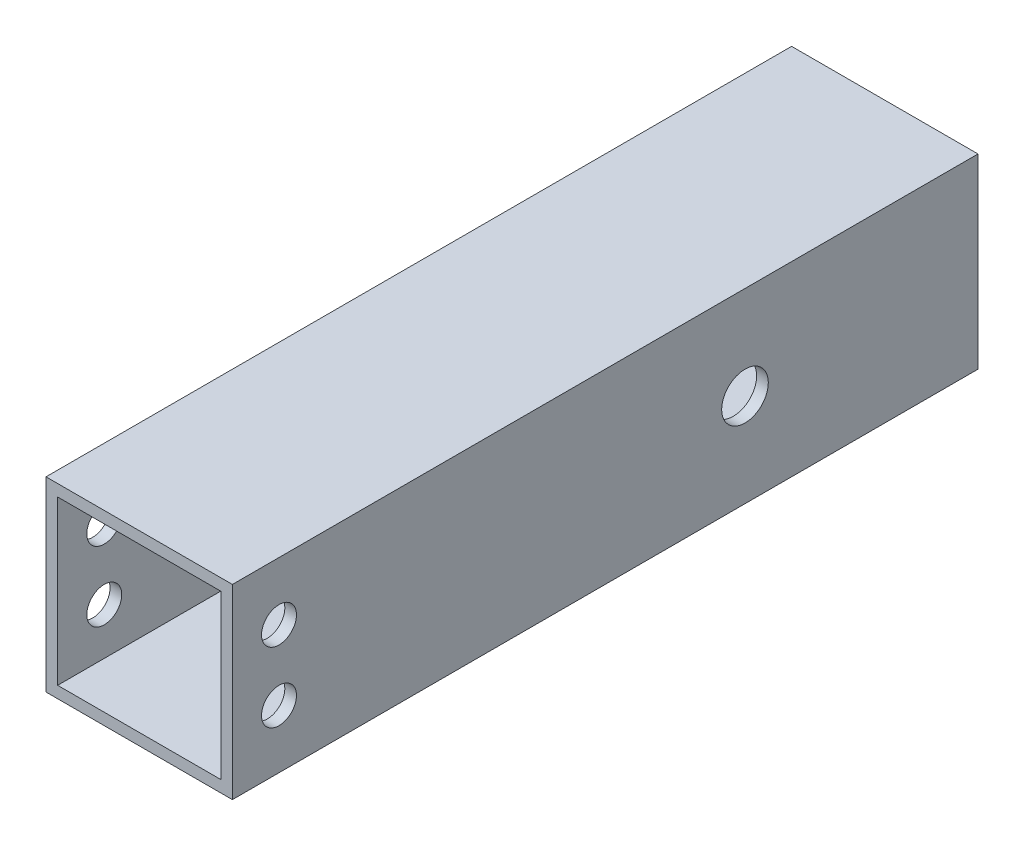
ISO-10303-21;
HEADER;
FILE_DESCRIPTION(('STEP AP214'),'2;1');
FILE_NAME('part.step','',(''),(''),'','','');
FILE_SCHEMA(('AUTOMOTIVE_DESIGN { 1 0 10303 214 1 1 1 1 }'));
ENDSEC;
DATA;
#1=APPLICATION_CONTEXT('core data for automotive mechanical design processes');
#2=APPLICATION_PROTOCOL_DEFINITION('international standard','automotive_design',2000,#1);
#3=PRODUCT_CONTEXT('',#1,'mechanical');
#4=PRODUCT('Part','Part','',(#3));
#5=PRODUCT_RELATED_PRODUCT_CATEGORY('part','',(#4));
#6=PRODUCT_DEFINITION_FORMATION('','',#4);
#7=PRODUCT_DEFINITION_CONTEXT('part definition',#1,'design');
#8=PRODUCT_DEFINITION('design','',#6,#7);
#9=PRODUCT_DEFINITION_SHAPE('','',#8);
#10=(LENGTH_UNIT() NAMED_UNIT(*) SI_UNIT(.MILLI.,.METRE.));
#11=(NAMED_UNIT(*) PLANE_ANGLE_UNIT() SI_UNIT($,.RADIAN.));
#12=(NAMED_UNIT(*) SI_UNIT($,.STERADIAN.) SOLID_ANGLE_UNIT());
#13=UNCERTAINTY_MEASURE_WITH_UNIT(LENGTH_MEASURE(1.E-05),#10,'distance_accuracy_value','');
#14=(GEOMETRIC_REPRESENTATION_CONTEXT(3) GLOBAL_UNCERTAINTY_ASSIGNED_CONTEXT((#13)) GLOBAL_UNIT_ASSIGNED_CONTEXT((#10,
#11,#12)) REPRESENTATION_CONTEXT('',''));
#15=CARTESIAN_POINT('',(0.,0.,0.));
#16=DIRECTION('',(0.,0.,1.));
#17=DIRECTION('',(1.,0.,0.));
#18=AXIS2_PLACEMENT_3D('',#15,#16,#17);
#19=CARTESIAN_POINT('',(0.,0.,101.6));
#20=DIRECTION('',(0.,0.,-1.));
#21=DIRECTION('',(-1.,0.,0.));
#22=AXIS2_PLACEMENT_3D('',#19,#20,#21);
#23=PLANE('',#22);
#24=DIRECTION('',(0.,1.,0.));
#25=VECTOR('',#24,1.);
#26=CARTESIAN_POINT('',(12.7,-12.7,101.6));
#27=LINE('',#26,#25);
#28=CARTESIAN_POINT('',(12.7,-12.7,101.6));
#29=VERTEX_POINT('',#28);
#30=CARTESIAN_POINT('',(12.7,12.7,101.6));
#31=VERTEX_POINT('',#30);
#32=EDGE_CURVE('E157',#29,#31,#27,.T.);
#33=ORIENTED_EDGE('',*,*,#32,.T.);
#34=DIRECTION('',(-1.,0.,0.));
#35=VECTOR('',#34,1.);
#36=CARTESIAN_POINT('',(-12.7,12.7,101.6));
#37=LINE('',#36,#35);
#38=CARTESIAN_POINT('',(-12.7,12.7,101.6));
#39=VERTEX_POINT('',#38);
#40=EDGE_CURVE('E161',#31,#39,#37,.T.);
#41=ORIENTED_EDGE('',*,*,#40,.T.);
#42=DIRECTION('',(0.,-1.,0.));
#43=VECTOR('',#42,1.);
#44=CARTESIAN_POINT('',(-12.7,-12.7,101.6));
#45=LINE('',#44,#43);
#46=CARTESIAN_POINT('',(-12.7,-12.7,101.6));
#47=VERTEX_POINT('',#46);
#48=EDGE_CURVE('E165',#39,#47,#45,.T.);
#49=ORIENTED_EDGE('',*,*,#48,.T.);
#50=DIRECTION('',(1.,0.,0.));
#51=VECTOR('',#50,1.);
#52=CARTESIAN_POINT('',(-12.7,-12.7,101.6));
#53=LINE('',#52,#51);
#54=EDGE_CURVE('E168',#47,#29,#53,.T.);
#55=ORIENTED_EDGE('',*,*,#54,.T.);
#56=EDGE_LOOP('',(#33,#41,#49,#55));
#57=FACE_BOUND('',#56,.T.);
#58=DIRECTION('',(0.,1.,0.));
#59=VECTOR('',#58,1.);
#60=CARTESIAN_POINT('',(11.1125,-11.1125,101.6));
#61=LINE('',#60,#59);
#62=CARTESIAN_POINT('',(11.1125,-11.1125,101.6));
#63=VERTEX_POINT('',#62);
#64=CARTESIAN_POINT('',(11.1125,11.1125,101.6));
#65=VERTEX_POINT('',#64);
#66=EDGE_CURVE('E107',#63,#65,#61,.T.);
#67=ORIENTED_EDGE('',*,*,#66,.F.);
#68=DIRECTION('',(1.,0.,0.));
#69=VECTOR('',#68,1.);
#70=CARTESIAN_POINT('',(-11.1125,-11.1125,101.6));
#71=LINE('',#70,#69);
#72=CARTESIAN_POINT('',(-11.1125,-11.1125,101.6));
#73=VERTEX_POINT('',#72);
#74=EDGE_CURVE('E133',#73,#63,#71,.T.);
#75=ORIENTED_EDGE('',*,*,#74,.F.);
#76=DIRECTION('',(0.,-1.,0.));
#77=VECTOR('',#76,1.);
#78=CARTESIAN_POINT('',(-11.1125,-11.1125,101.6));
#79=LINE('',#78,#77);
#80=CARTESIAN_POINT('',(-11.1125,11.1125,101.6));
#81=VERTEX_POINT('',#80);
#82=EDGE_CURVE('E129',#81,#73,#79,.T.);
#83=ORIENTED_EDGE('',*,*,#82,.F.);
#84=DIRECTION('',(-1.,0.,0.));
#85=VECTOR('',#84,1.);
#86=CARTESIAN_POINT('',(-11.1125,11.1125,101.6));
#87=LINE('',#86,#85);
#88=EDGE_CURVE('E116',#65,#81,#87,.T.);
#89=ORIENTED_EDGE('',*,*,#88,.F.);
#90=EDGE_LOOP('',(#67,#75,#83,#89));
#91=FACE_BOUND('',#90,.T.);
#92=ADVANCED_FACE('F39',(#57,#91),#23,.F.);
#93=CARTESIAN_POINT('',(0.,0.,0.));
#94=DIRECTION('',(0.,0.,-1.));
#95=DIRECTION('',(-1.,0.,0.));
#96=AXIS2_PLACEMENT_3D('',#93,#94,#95);
#97=PLANE('',#96);
#98=DIRECTION('',(0.,1.,0.));
#99=VECTOR('',#98,1.);
#100=CARTESIAN_POINT('',(12.7,-12.7,0.));
#101=LINE('',#100,#99);
#102=CARTESIAN_POINT('',(12.7,-12.7,0.));
#103=VERTEX_POINT('',#102);
#104=CARTESIAN_POINT('',(12.7,12.7,0.));
#105=VERTEX_POINT('',#104);
#106=EDGE_CURVE('E125',#103,#105,#101,.T.);
#107=ORIENTED_EDGE('',*,*,#106,.F.);
#108=DIRECTION('',(1.,0.,0.));
#109=VECTOR('',#108,1.);
#110=CARTESIAN_POINT('',(-12.7,-12.7,0.));
#111=LINE('',#110,#109);
#112=CARTESIAN_POINT('',(-12.7,-12.7,0.));
#113=VERTEX_POINT('',#112);
#114=EDGE_CURVE('E162',#113,#103,#111,.T.);
#115=ORIENTED_EDGE('',*,*,#114,.F.);
#116=DIRECTION('',(0.,-1.,0.));
#117=VECTOR('',#116,1.);
#118=CARTESIAN_POINT('',(-12.7,-12.7,0.));
#119=LINE('',#118,#117);
#120=CARTESIAN_POINT('',(-12.7,12.7,0.));
#121=VERTEX_POINT('',#120);
#122=EDGE_CURVE('E178',#121,#113,#119,.T.);
#123=ORIENTED_EDGE('',*,*,#122,.F.);
#124=DIRECTION('',(-1.,0.,0.));
#125=VECTOR('',#124,1.);
#126=CARTESIAN_POINT('',(-12.7,12.7,0.));
#127=LINE('',#126,#125);
#128=EDGE_CURVE('E175',#105,#121,#127,.T.);
#129=ORIENTED_EDGE('',*,*,#128,.F.);
#130=EDGE_LOOP('',(#107,#115,#123,#129));
#131=FACE_BOUND('',#130,.T.);
#132=DIRECTION('',(1.,0.,0.));
#133=VECTOR('',#132,1.);
#134=CARTESIAN_POINT('',(-11.1125,-11.1125,0.));
#135=LINE('',#134,#133);
#136=CARTESIAN_POINT('',(-11.1125,-11.1125,0.));
#137=VERTEX_POINT('',#136);
#138=CARTESIAN_POINT('',(11.1125,-11.1125,0.));
#139=VERTEX_POINT('',#138);
#140=EDGE_CURVE('E117',#137,#139,#135,.T.);
#141=ORIENTED_EDGE('',*,*,#140,.T.);
#142=DIRECTION('',(0.,1.,0.));
#143=VECTOR('',#142,1.);
#144=CARTESIAN_POINT('',(11.1125,-11.1125,0.));
#145=LINE('',#144,#143);
#146=CARTESIAN_POINT('',(11.1125,11.1125,0.));
#147=VERTEX_POINT('',#146);
#148=EDGE_CURVE('E65',#139,#147,#145,.T.);
#149=ORIENTED_EDGE('',*,*,#148,.T.);
#150=DIRECTION('',(-1.,0.,0.));
#151=VECTOR('',#150,1.);
#152=CARTESIAN_POINT('',(-11.1125,11.1125,0.));
#153=LINE('',#152,#151);
#154=CARTESIAN_POINT('',(-11.1125,11.1125,0.));
#155=VERTEX_POINT('',#154);
#156=EDGE_CURVE('E123',#147,#155,#153,.T.);
#157=ORIENTED_EDGE('',*,*,#156,.T.);
#158=DIRECTION('',(0.,-1.,0.));
#159=VECTOR('',#158,1.);
#160=CARTESIAN_POINT('',(-11.1125,-11.1125,0.));
#161=LINE('',#160,#159);
#162=EDGE_CURVE('E144',#155,#137,#161,.T.);
#163=ORIENTED_EDGE('',*,*,#162,.T.);
#164=EDGE_LOOP('',(#141,#149,#157,#163));
#165=FACE_BOUND('',#164,.T.);
#166=ADVANCED_FACE('F235',(#131,#165),#97,.T.);
#167=CARTESIAN_POINT('',(12.7,-12.7,101.6));
#168=DIRECTION('',(-1.,0.,0.));
#169=DIRECTION('',(0.,0.,1.));
#170=AXIS2_PLACEMENT_3D('',#167,#168,#169);
#171=PLANE('',#170);
#172=CARTESIAN_POINT('',(12.7,0.,31.75));
#173=DIRECTION('',(1.,0.,0.));
#174=DIRECTION('',(0.,0.,-1.));
#175=AXIS2_PLACEMENT_3D('',#172,#173,#174);
#176=CIRCLE('',#175,3.175);
#177=CARTESIAN_POINT('',(12.7,0.,28.575));
#178=VERTEX_POINT('',#177);
#179=EDGE_CURVE('E288',#178,#178,#176,.T.);
#180=ORIENTED_EDGE('',*,*,#179,.F.);
#181=EDGE_LOOP('',(#180));
#182=FACE_BOUND('',#181,.T.);
#183=CARTESIAN_POINT('',(12.7,-4.7625,95.25));
#184=DIRECTION('',(1.,0.,0.));
#185=DIRECTION('',(0.,0.,-1.));
#186=AXIS2_PLACEMENT_3D('',#183,#184,#185);
#187=CIRCLE('',#186,2.38125000000001);
#188=CARTESIAN_POINT('',(12.7,-4.7625,92.86875));
#189=VERTEX_POINT('',#188);
#190=EDGE_CURVE('E292',#189,#189,#187,.T.);
#191=ORIENTED_EDGE('',*,*,#190,.F.);
#192=EDGE_LOOP('',(#191));
#193=FACE_BOUND('',#192,.T.);
#194=CARTESIAN_POINT('',(12.7,4.7625,95.25));
#195=DIRECTION('',(1.,0.,0.));
#196=DIRECTION('',(0.,0.,-1.));
#197=AXIS2_PLACEMENT_3D('',#194,#195,#196);
#198=CIRCLE('',#197,2.38125000000001);
#199=CARTESIAN_POINT('',(12.7,4.7625,92.86875));
#200=VERTEX_POINT('',#199);
#201=EDGE_CURVE('E295',#200,#200,#198,.T.);
#202=ORIENTED_EDGE('',*,*,#201,.F.);
#203=EDGE_LOOP('',(#202));
#204=FACE_BOUND('',#203,.T.);
#205=ORIENTED_EDGE('',*,*,#106,.T.);
#206=DIRECTION('',(0.,0.,-1.));
#207=VECTOR('',#206,1.);
#208=CARTESIAN_POINT('',(12.7,12.7,101.6));
#209=LINE('',#208,#207);
#210=EDGE_CURVE('E11',#31,#105,#209,.T.);
#211=ORIENTED_EDGE('',*,*,#210,.F.);
#212=ORIENTED_EDGE('',*,*,#32,.F.);
#213=DIRECTION('',(0.,0.,-1.));
#214=VECTOR('',#213,1.);
#215=CARTESIAN_POINT('',(12.7,-12.7,101.6));
#216=LINE('',#215,#214);
#217=EDGE_CURVE('E171',#29,#103,#216,.T.);
#218=ORIENTED_EDGE('',*,*,#217,.T.);
#219=EDGE_LOOP('',(#205,#211,#212,#218));
#220=FACE_BOUND('',#219,.T.);
#221=ADVANCED_FACE('F41',(#182,#193,#204,#220),#171,.F.);
#222=CARTESIAN_POINT('',(-12.7,12.7,101.6));
#223=DIRECTION('',(0.,-1.,0.));
#224=DIRECTION('',(0.,0.,-1.));
#225=AXIS2_PLACEMENT_3D('',#222,#223,#224);
#226=PLANE('',#225);
#227=ORIENTED_EDGE('',*,*,#128,.T.);
#228=DIRECTION('',(0.,0.,-1.));
#229=VECTOR('',#228,1.);
#230=CARTESIAN_POINT('',(-12.7,12.7,101.6));
#231=LINE('',#230,#229);
#232=EDGE_CURVE('E49',#39,#121,#231,.T.);
#233=ORIENTED_EDGE('',*,*,#232,.F.);
#234=ORIENTED_EDGE('',*,*,#40,.F.);
#235=ORIENTED_EDGE('',*,*,#210,.T.);
#236=EDGE_LOOP('',(#227,#233,#234,#235));
#237=FACE_BOUND('',#236,.T.);
#238=ADVANCED_FACE('F263',(#237),#226,.F.);
#239=CARTESIAN_POINT('',(-12.7,-12.7,101.6));
#240=DIRECTION('',(1.,0.,0.));
#241=DIRECTION('',(0.,0.,-1.));
#242=AXIS2_PLACEMENT_3D('',#239,#240,#241);
#243=PLANE('',#242);
#244=CARTESIAN_POINT('',(-12.7,0.,31.75));
#245=DIRECTION('',(1.,0.,0.));
#246=DIRECTION('',(0.,0.,-1.));
#247=AXIS2_PLACEMENT_3D('',#244,#245,#246);
#248=CIRCLE('',#247,3.175);
#249=CARTESIAN_POINT('',(-12.7,0.,28.575));
#250=VERTEX_POINT('',#249);
#251=EDGE_CURVE('E305',#250,#250,#248,.F.);
#252=ORIENTED_EDGE('',*,*,#251,.F.);
#253=EDGE_LOOP('',(#252));
#254=FACE_BOUND('',#253,.T.);
#255=CARTESIAN_POINT('',(-12.7,-4.7625,95.25));
#256=DIRECTION('',(1.,0.,0.));
#257=DIRECTION('',(0.,0.,-1.));
#258=AXIS2_PLACEMENT_3D('',#255,#256,#257);
#259=CIRCLE('',#258,2.38125000000001);
#260=CARTESIAN_POINT('',(-12.7,-4.7625,92.86875));
#261=VERTEX_POINT('',#260);
#262=EDGE_CURVE('E298',#261,#261,#259,.F.);
#263=ORIENTED_EDGE('',*,*,#262,.F.);
#264=EDGE_LOOP('',(#263));
#265=FACE_BOUND('',#264,.T.);
#266=CARTESIAN_POINT('',(-12.7,4.7625,95.25));
#267=DIRECTION('',(1.,0.,0.));
#268=DIRECTION('',(0.,0.,-1.));
#269=AXIS2_PLACEMENT_3D('',#266,#267,#268);
#270=CIRCLE('',#269,2.38125000000001);
#271=CARTESIAN_POINT('',(-12.7,4.7625,92.86875));
#272=VERTEX_POINT('',#271);
#273=EDGE_CURVE('E197',#272,#272,#270,.F.);
#274=ORIENTED_EDGE('',*,*,#273,.F.);
#275=EDGE_LOOP('',(#274));
#276=FACE_BOUND('',#275,.T.);
#277=ORIENTED_EDGE('',*,*,#122,.T.);
#278=DIRECTION('',(0.,0.,-1.));
#279=VECTOR('',#278,1.);
#280=CARTESIAN_POINT('',(-12.7,-12.7,101.6));
#281=LINE('',#280,#279);
#282=EDGE_CURVE('E186',#47,#113,#281,.T.);
#283=ORIENTED_EDGE('',*,*,#282,.F.);
#284=ORIENTED_EDGE('',*,*,#48,.F.);
#285=ORIENTED_EDGE('',*,*,#232,.T.);
#286=EDGE_LOOP('',(#277,#283,#284,#285));
#287=FACE_BOUND('',#286,.T.);
#288=ADVANCED_FACE('F260',(#254,#265,#276,#287),#243,.F.);
#289=CARTESIAN_POINT('',(-12.7,-12.7,101.6));
#290=DIRECTION('',(0.,1.,0.));
#291=DIRECTION('',(0.,0.,1.));
#292=AXIS2_PLACEMENT_3D('',#289,#290,#291);
#293=PLANE('',#292);
#294=ORIENTED_EDGE('',*,*,#114,.T.);
#295=ORIENTED_EDGE('',*,*,#217,.F.);
#296=ORIENTED_EDGE('',*,*,#54,.F.);
#297=ORIENTED_EDGE('',*,*,#282,.T.);
#298=EDGE_LOOP('',(#294,#295,#296,#297));
#299=FACE_BOUND('',#298,.T.);
#300=ADVANCED_FACE('F257',(#299),#293,.F.);
#301=CARTESIAN_POINT('',(11.1125,-11.1125,101.6));
#302=DIRECTION('',(-1.,0.,0.));
#303=DIRECTION('',(0.,0.,1.));
#304=AXIS2_PLACEMENT_3D('',#301,#302,#303);
#305=PLANE('',#304);
#306=CARTESIAN_POINT('',(11.1125,0.,31.75));
#307=DIRECTION('',(-1.,0.,0.));
#308=DIRECTION('',(0.,0.,1.));
#309=AXIS2_PLACEMENT_3D('',#306,#307,#308);
#310=CIRCLE('',#309,3.175);
#311=CARTESIAN_POINT('',(11.1125,0.,34.925));
#312=VERTEX_POINT('',#311);
#313=EDGE_CURVE('E141',#312,#312,#310,.T.);
#314=ORIENTED_EDGE('',*,*,#313,.F.);
#315=EDGE_LOOP('',(#314));
#316=FACE_BOUND('',#315,.T.);
#317=CARTESIAN_POINT('',(11.1125,-4.7625,95.25));
#318=DIRECTION('',(-1.,0.,0.));
#319=DIRECTION('',(0.,0.,1.));
#320=AXIS2_PLACEMENT_3D('',#317,#318,#319);
#321=CIRCLE('',#320,2.38125000000001);
#322=CARTESIAN_POINT('',(11.1125,-4.7625,97.63125));
#323=VERTEX_POINT('',#322);
#324=EDGE_CURVE('E201',#323,#323,#321,.T.);
#325=ORIENTED_EDGE('',*,*,#324,.F.);
#326=EDGE_LOOP('',(#325));
#327=FACE_BOUND('',#326,.T.);
#328=CARTESIAN_POINT('',(11.1125,4.7625,95.25));
#329=DIRECTION('',(-1.,0.,0.));
#330=DIRECTION('',(0.,0.,1.));
#331=AXIS2_PLACEMENT_3D('',#328,#329,#330);
#332=CIRCLE('',#331,2.38125000000001);
#333=CARTESIAN_POINT('',(11.1125,4.7625,97.63125));
#334=VERTEX_POINT('',#333);
#335=EDGE_CURVE('E196',#334,#334,#332,.T.);
#336=ORIENTED_EDGE('',*,*,#335,.F.);
#337=EDGE_LOOP('',(#336));
#338=FACE_BOUND('',#337,.T.);
#339=ORIENTED_EDGE('',*,*,#148,.F.);
#340=DIRECTION('',(0.,0.,-1.));
#341=VECTOR('',#340,1.);
#342=CARTESIAN_POINT('',(11.1125,-11.1125,101.6));
#343=LINE('',#342,#341);
#344=EDGE_CURVE('E111',#63,#139,#343,.T.);
#345=ORIENTED_EDGE('',*,*,#344,.F.);
#346=ORIENTED_EDGE('',*,*,#66,.T.);
#347=DIRECTION('',(0.,0.,-1.));
#348=VECTOR('',#347,1.);
#349=CARTESIAN_POINT('',(11.1125,11.1125,101.6));
#350=LINE('',#349,#348);
#351=EDGE_CURVE('E110',#65,#147,#350,.T.);
#352=ORIENTED_EDGE('',*,*,#351,.T.);
#353=EDGE_LOOP('',(#339,#345,#346,#352));
#354=FACE_BOUND('',#353,.T.);
#355=ADVANCED_FACE('F109',(#316,#327,#338,#354),#305,.T.);
#356=CARTESIAN_POINT('',(-11.1125,11.1125,101.6));
#357=DIRECTION('',(0.,-1.,0.));
#358=DIRECTION('',(0.,0.,-1.));
#359=AXIS2_PLACEMENT_3D('',#356,#357,#358);
#360=PLANE('',#359);
#361=ORIENTED_EDGE('',*,*,#156,.F.);
#362=ORIENTED_EDGE('',*,*,#351,.F.);
#363=ORIENTED_EDGE('',*,*,#88,.T.);
#364=DIRECTION('',(0.,0.,-1.));
#365=VECTOR('',#364,1.);
#366=CARTESIAN_POINT('',(-11.1125,11.1125,101.6));
#367=LINE('',#366,#365);
#368=EDGE_CURVE('E126',#81,#155,#367,.T.);
#369=ORIENTED_EDGE('',*,*,#368,.T.);
#370=EDGE_LOOP('',(#361,#362,#363,#369));
#371=FACE_BOUND('',#370,.T.);
#372=ADVANCED_FACE('F120',(#371),#360,.T.);
#373=CARTESIAN_POINT('',(-11.1125,-11.1125,101.6));
#374=DIRECTION('',(1.,0.,0.));
#375=DIRECTION('',(0.,0.,-1.));
#376=AXIS2_PLACEMENT_3D('',#373,#374,#375);
#377=PLANE('',#376);
#378=CARTESIAN_POINT('',(-11.1125,0.,31.75));
#379=DIRECTION('',(1.,0.,0.));
#380=DIRECTION('',(0.,0.,-1.));
#381=AXIS2_PLACEMENT_3D('',#378,#379,#380);
#382=CIRCLE('',#381,3.175);
#383=CARTESIAN_POINT('',(-11.1125,0.,28.575));
#384=VERTEX_POINT('',#383);
#385=EDGE_CURVE('E43',#384,#384,#382,.T.);
#386=ORIENTED_EDGE('',*,*,#385,.F.);
#387=EDGE_LOOP('',(#386));
#388=FACE_BOUND('',#387,.T.);
#389=CARTESIAN_POINT('',(-11.1125,-4.7625,95.25));
#390=DIRECTION('',(1.,0.,0.));
#391=DIRECTION('',(0.,0.,-1.));
#392=AXIS2_PLACEMENT_3D('',#389,#390,#391);
#393=CIRCLE('',#392,2.38125000000001);
#394=CARTESIAN_POINT('',(-11.1125,-4.7625,92.86875));
#395=VERTEX_POINT('',#394);
#396=EDGE_CURVE('E198',#395,#395,#393,.T.);
#397=ORIENTED_EDGE('',*,*,#396,.F.);
#398=EDGE_LOOP('',(#397));
#399=FACE_BOUND('',#398,.T.);
#400=CARTESIAN_POINT('',(-11.1125,4.7625,95.25));
#401=DIRECTION('',(1.,0.,0.));
#402=DIRECTION('',(0.,0.,-1.));
#403=AXIS2_PLACEMENT_3D('',#400,#401,#402);
#404=CIRCLE('',#403,2.38125000000001);
#405=CARTESIAN_POINT('',(-11.1125,4.7625,92.86875));
#406=VERTEX_POINT('',#405);
#407=EDGE_CURVE('E193',#406,#406,#404,.T.);
#408=ORIENTED_EDGE('',*,*,#407,.F.);
#409=EDGE_LOOP('',(#408));
#410=FACE_BOUND('',#409,.T.);
#411=ORIENTED_EDGE('',*,*,#162,.F.);
#412=ORIENTED_EDGE('',*,*,#368,.F.);
#413=ORIENTED_EDGE('',*,*,#82,.T.);
#414=DIRECTION('',(0.,0.,-1.));
#415=VECTOR('',#414,1.);
#416=CARTESIAN_POINT('',(-11.1125,-11.1125,101.6));
#417=LINE('',#416,#415);
#418=EDGE_CURVE('E57',#73,#137,#417,.T.);
#419=ORIENTED_EDGE('',*,*,#418,.T.);
#420=EDGE_LOOP('',(#411,#412,#413,#419));
#421=FACE_BOUND('',#420,.T.);
#422=ADVANCED_FACE('F225',(#388,#399,#410,#421),#377,.T.);
#423=CARTESIAN_POINT('',(-11.1125,-11.1125,101.6));
#424=DIRECTION('',(0.,1.,0.));
#425=DIRECTION('',(0.,0.,1.));
#426=AXIS2_PLACEMENT_3D('',#423,#424,#425);
#427=PLANE('',#426);
#428=ORIENTED_EDGE('',*,*,#140,.F.);
#429=ORIENTED_EDGE('',*,*,#418,.F.);
#430=ORIENTED_EDGE('',*,*,#74,.T.);
#431=ORIENTED_EDGE('',*,*,#344,.T.);
#432=EDGE_LOOP('',(#428,#429,#430,#431));
#433=FACE_BOUND('',#432,.T.);
#434=ADVANCED_FACE('F228',(#433),#427,.T.);
#435=CARTESIAN_POINT('',(-21.6802561210691,4.7625,95.25));
#436=DIRECTION('',(1.,0.,0.));
#437=DIRECTION('',(0.,0.,-1.));
#438=AXIS2_PLACEMENT_3D('',#435,#436,#437);
#439=CYLINDRICAL_SURFACE('',#438,2.38125000000001);
#440=ORIENTED_EDGE('',*,*,#407,.T.);
#441=EDGE_LOOP('',(#440));
#442=FACE_BOUND('',#441,.T.);
#443=ORIENTED_EDGE('',*,*,#273,.T.);
#444=EDGE_LOOP('',(#443));
#445=FACE_BOUND('',#444,.T.);
#446=ADVANCED_FACE('F237',(#442,#445),#439,.F.);
#447=CARTESIAN_POINT('',(-21.6802561210691,-4.7625,95.25));
#448=DIRECTION('',(1.,0.,0.));
#449=DIRECTION('',(0.,0.,-1.));
#450=AXIS2_PLACEMENT_3D('',#447,#448,#449);
#451=CYLINDRICAL_SURFACE('',#450,2.38125000000001);
#452=ORIENTED_EDGE('',*,*,#396,.T.);
#453=EDGE_LOOP('',(#452));
#454=FACE_BOUND('',#453,.T.);
#455=ORIENTED_EDGE('',*,*,#262,.T.);
#456=EDGE_LOOP('',(#455));
#457=FACE_BOUND('',#456,.T.);
#458=ADVANCED_FACE('F242',(#454,#457),#451,.F.);
#459=CARTESIAN_POINT('',(-21.6802561210691,0.,31.75));
#460=DIRECTION('',(1.,0.,0.));
#461=DIRECTION('',(0.,0.,-1.));
#462=AXIS2_PLACEMENT_3D('',#459,#460,#461);
#463=CYLINDRICAL_SURFACE('',#462,3.175);
#464=ORIENTED_EDGE('',*,*,#385,.T.);
#465=EDGE_LOOP('',(#464));
#466=FACE_BOUND('',#465,.T.);
#467=ORIENTED_EDGE('',*,*,#251,.T.);
#468=EDGE_LOOP('',(#467));
#469=FACE_BOUND('',#468,.T.);
#470=ADVANCED_FACE('F222',(#466,#469),#463,.F.);
#471=ORIENTED_EDGE('',*,*,#335,.T.);
#472=EDGE_LOOP('',(#471));
#473=FACE_BOUND('',#472,.T.);
#474=ORIENTED_EDGE('',*,*,#201,.T.);
#475=EDGE_LOOP('',(#474));
#476=FACE_BOUND('',#475,.T.);
#477=ADVANCED_FACE('F245',(#473,#476),#439,.F.);
#478=ORIENTED_EDGE('',*,*,#324,.T.);
#479=EDGE_LOOP('',(#478));
#480=FACE_BOUND('',#479,.T.);
#481=ORIENTED_EDGE('',*,*,#190,.T.);
#482=EDGE_LOOP('',(#481));
#483=FACE_BOUND('',#482,.T.);
#484=ADVANCED_FACE('F313',(#480,#483),#451,.F.);
#485=ORIENTED_EDGE('',*,*,#313,.T.);
#486=EDGE_LOOP('',(#485));
#487=FACE_BOUND('',#486,.T.);
#488=ORIENTED_EDGE('',*,*,#179,.T.);
#489=EDGE_LOOP('',(#488));
#490=FACE_BOUND('',#489,.T.);
#491=ADVANCED_FACE('F315',(#487,#490),#463,.F.);
#492=CLOSED_SHELL('',(#92,#166,#221,#238,#288,#300,#355,#372,#422,#434,#446,#458,#470,#477,#484,#491));
#493=MANIFOLD_SOLID_BREP('B2',#492);
#494=ADVANCED_BREP_SHAPE_REPRESENTATION('',(#18,#493),#14);
#495=SHAPE_DEFINITION_REPRESENTATION(#9,#494);
ENDSEC;
END-ISO-10303-21;
